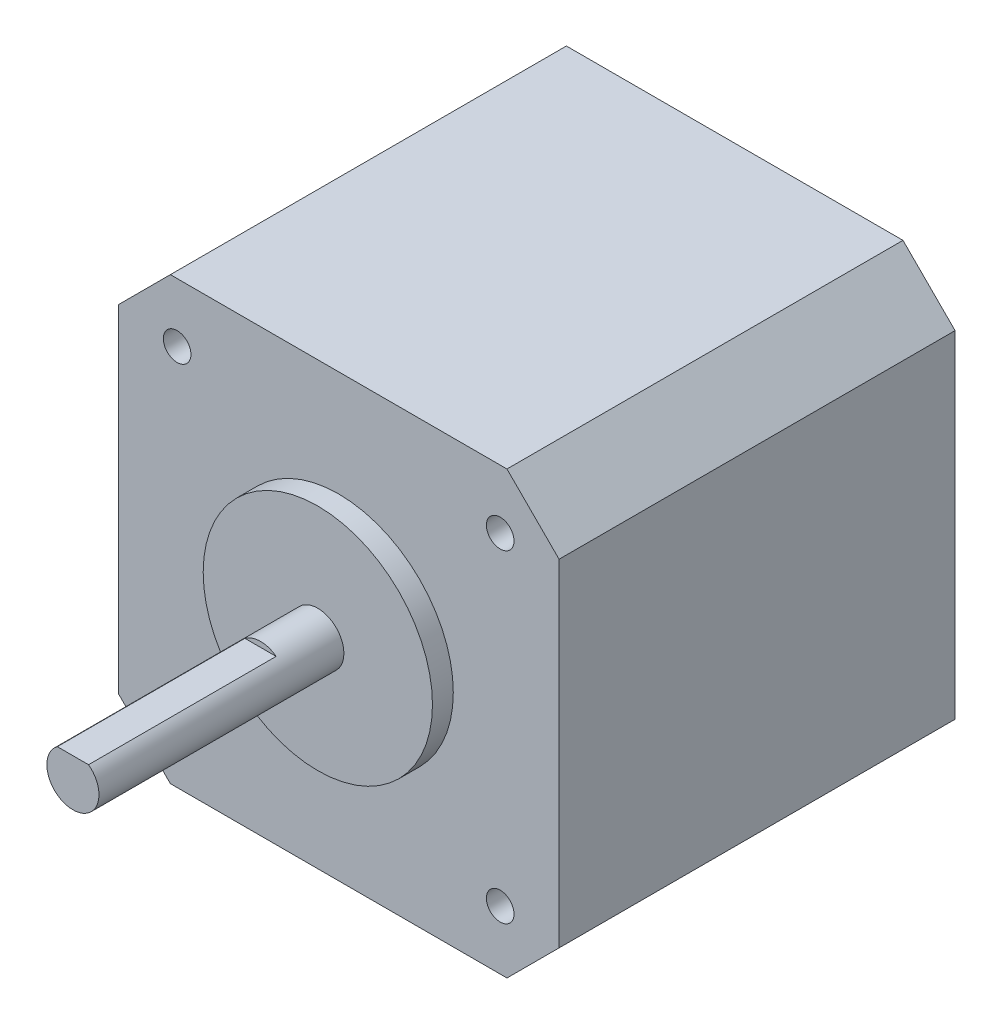
ISO-10303-21;
HEADER;
FILE_DESCRIPTION(('STEP AP214'),'2;1');
FILE_NAME('part.step','',(''),(''),'','','');
FILE_SCHEMA(('AUTOMOTIVE_DESIGN { 1 0 10303 214 1 1 1 1 }'));
ENDSEC;
DATA;
#1=APPLICATION_CONTEXT('core data for automotive mechanical design processes');
#2=APPLICATION_PROTOCOL_DEFINITION('international standard','automotive_design',2000,#1);
#3=PRODUCT_CONTEXT('',#1,'mechanical');
#4=PRODUCT('Part','Part','',(#3));
#5=PRODUCT_RELATED_PRODUCT_CATEGORY('part','',(#4));
#6=PRODUCT_DEFINITION_FORMATION('','',#4);
#7=PRODUCT_DEFINITION_CONTEXT('part definition',#1,'design');
#8=PRODUCT_DEFINITION('design','',#6,#7);
#9=PRODUCT_DEFINITION_SHAPE('','',#8);
#10=(LENGTH_UNIT() NAMED_UNIT(*) SI_UNIT(.MILLI.,.METRE.));
#11=(NAMED_UNIT(*) PLANE_ANGLE_UNIT() SI_UNIT($,.RADIAN.));
#12=(NAMED_UNIT(*) SI_UNIT($,.STERADIAN.) SOLID_ANGLE_UNIT());
#13=UNCERTAINTY_MEASURE_WITH_UNIT(LENGTH_MEASURE(1.E-05),#10,'distance_accuracy_value','');
#14=(GEOMETRIC_REPRESENTATION_CONTEXT(3) GLOBAL_UNCERTAINTY_ASSIGNED_CONTEXT((#13)) GLOBAL_UNIT_ASSIGNED_CONTEXT((#10,
#11,#12)) REPRESENTATION_CONTEXT('',''));
#15=CARTESIAN_POINT('',(0.,0.,0.));
#16=DIRECTION('',(0.,0.,1.));
#17=DIRECTION('',(1.,0.,0.));
#18=AXIS2_PLACEMENT_3D('',#15,#16,#17);
#19=CARTESIAN_POINT('',(-21.15,-16.15,-38.));
#20=DIRECTION('',(-1.,0.,0.));
#21=DIRECTION('',(0.,0.,1.));
#22=AXIS2_PLACEMENT_3D('',#19,#20,#21);
#23=PLANE('',#22);
#24=DIRECTION('',(0.,-1.,0.));
#25=VECTOR('',#24,1.);
#26=CARTESIAN_POINT('',(-21.15,-16.15,0.));
#27=LINE('',#26,#25);
#28=CARTESIAN_POINT('',(-21.1500000000002,16.15,0.));
#29=VERTEX_POINT('',#28);
#30=CARTESIAN_POINT('',(-21.15,-16.15,0.));
#31=VERTEX_POINT('',#30);
#32=EDGE_CURVE('E152',#29,#31,#27,.T.);
#33=ORIENTED_EDGE('',*,*,#32,.F.);
#34=DIRECTION('',(0.,0.,1.));
#35=VECTOR('',#34,1.);
#36=CARTESIAN_POINT('',(-21.15,16.15,-38.));
#37=LINE('',#36,#35);
#38=CARTESIAN_POINT('',(-21.15,16.15,-38.));
#39=VERTEX_POINT('',#38);
#40=EDGE_CURVE('E64',#39,#29,#37,.T.);
#41=ORIENTED_EDGE('',*,*,#40,.F.);
#42=DIRECTION('',(0.,-1.,0.));
#43=VECTOR('',#42,1.);
#44=CARTESIAN_POINT('',(-21.15,-16.15,-38.));
#45=LINE('',#44,#43);
#46=CARTESIAN_POINT('',(-21.15,-16.15,-38.));
#47=VERTEX_POINT('',#46);
#48=EDGE_CURVE('E174',#39,#47,#45,.T.);
#49=ORIENTED_EDGE('',*,*,#48,.T.);
#50=DIRECTION('',(0.,0.,1.));
#51=VECTOR('',#50,1.);
#52=CARTESIAN_POINT('',(-21.15,-16.15,-38.));
#53=LINE('',#52,#51);
#54=EDGE_CURVE('E103',#47,#31,#53,.T.);
#55=ORIENTED_EDGE('',*,*,#54,.T.);
#56=EDGE_LOOP('',(#33,#41,#49,#55));
#57=FACE_BOUND('',#56,.T.);
#58=ADVANCED_FACE('F40',(#57),#23,.T.);
#59=CARTESIAN_POINT('',(-21.15,16.15,-38.));
#60=DIRECTION('',(-0.707106781186548,0.707106781186548,0.));
#61=DIRECTION('',(-0.707106781186548,-0.707106781186548,0.));
#62=AXIS2_PLACEMENT_3D('',#59,#60,#61);
#63=PLANE('',#62);
#64=DIRECTION('',(-0.707106781186548,-0.707106781186548,0.));
#65=VECTOR('',#64,1.);
#66=CARTESIAN_POINT('',(-21.1500000000002,16.15,0.));
#67=LINE('',#66,#65);
#68=CARTESIAN_POINT('',(-16.1500000000002,21.15,0.));
#69=VERTEX_POINT('',#68);
#70=EDGE_CURVE('E171',#69,#29,#67,.T.);
#71=ORIENTED_EDGE('',*,*,#70,.F.);
#72=DIRECTION('',(0.,0.,1.));
#73=VECTOR('',#72,1.);
#74=CARTESIAN_POINT('',(-16.15,21.15,-38.));
#75=LINE('',#74,#73);
#76=CARTESIAN_POINT('',(-16.15,21.15,-38.));
#77=VERTEX_POINT('',#76);
#78=EDGE_CURVE('E133',#77,#69,#75,.T.);
#79=ORIENTED_EDGE('',*,*,#78,.F.);
#80=DIRECTION('',(-0.707106781186548,-0.707106781186548,0.));
#81=VECTOR('',#80,1.);
#82=CARTESIAN_POINT('',(-21.15,16.15,-38.));
#83=LINE('',#82,#81);
#84=EDGE_CURVE('E142',#77,#39,#83,.T.);
#85=ORIENTED_EDGE('',*,*,#84,.T.);
#86=ORIENTED_EDGE('',*,*,#40,.T.);
#87=EDGE_LOOP('',(#71,#79,#85,#86));
#88=FACE_BOUND('',#87,.T.);
#89=ADVANCED_FACE('F187',(#88),#63,.T.);
#90=CARTESIAN_POINT('',(-16.15,21.15,-38.));
#91=DIRECTION('',(0.,1.,0.));
#92=DIRECTION('',(0.,0.,1.));
#93=AXIS2_PLACEMENT_3D('',#90,#91,#92);
#94=PLANE('',#93);
#95=DIRECTION('',(-1.,0.,0.));
#96=VECTOR('',#95,1.);
#97=CARTESIAN_POINT('',(-16.1500000000002,21.15,0.));
#98=LINE('',#97,#96);
#99=CARTESIAN_POINT('',(16.1499999999998,21.15,0.));
#100=VERTEX_POINT('',#99);
#101=EDGE_CURVE('E128',#100,#69,#98,.T.);
#102=ORIENTED_EDGE('',*,*,#101,.F.);
#103=DIRECTION('',(0.,0.,1.));
#104=VECTOR('',#103,1.);
#105=CARTESIAN_POINT('',(16.1500000000001,21.15,-38.));
#106=LINE('',#105,#104);
#107=CARTESIAN_POINT('',(16.1500000000001,21.15,-38.));
#108=VERTEX_POINT('',#107);
#109=EDGE_CURVE('E122',#108,#100,#106,.T.);
#110=ORIENTED_EDGE('',*,*,#109,.F.);
#111=DIRECTION('',(-1.,0.,0.));
#112=VECTOR('',#111,1.);
#113=CARTESIAN_POINT('',(-16.15,21.15,-38.));
#114=LINE('',#113,#112);
#115=EDGE_CURVE('E125',#108,#77,#114,.T.);
#116=ORIENTED_EDGE('',*,*,#115,.T.);
#117=ORIENTED_EDGE('',*,*,#78,.T.);
#118=EDGE_LOOP('',(#102,#110,#116,#117));
#119=FACE_BOUND('',#118,.T.);
#120=ADVANCED_FACE('F124',(#119),#94,.T.);
#121=CARTESIAN_POINT('',(16.1500000000001,21.15,-38.));
#122=DIRECTION('',(0.707106781186548,0.707106781186548,0.));
#123=DIRECTION('',(-0.707106781186548,0.707106781186548,0.));
#124=AXIS2_PLACEMENT_3D('',#121,#122,#123);
#125=PLANE('',#124);
#126=DIRECTION('',(-0.707106781186548,0.707106781186548,0.));
#127=VECTOR('',#126,1.);
#128=CARTESIAN_POINT('',(16.1499999999998,21.15,0.));
#129=LINE('',#128,#127);
#130=CARTESIAN_POINT('',(21.1499999999998,16.15,0.));
#131=VERTEX_POINT('',#130);
#132=EDGE_CURVE('E168',#131,#100,#129,.T.);
#133=ORIENTED_EDGE('',*,*,#132,.F.);
#134=DIRECTION('',(0.,0.,1.));
#135=VECTOR('',#134,1.);
#136=CARTESIAN_POINT('',(21.1500000000001,16.15,-38.));
#137=LINE('',#136,#135);
#138=CARTESIAN_POINT('',(21.1500000000001,16.15,-38.));
#139=VERTEX_POINT('',#138);
#140=EDGE_CURVE('E134',#139,#131,#137,.T.);
#141=ORIENTED_EDGE('',*,*,#140,.F.);
#142=DIRECTION('',(-0.707106781186548,0.707106781186548,0.));
#143=VECTOR('',#142,1.);
#144=CARTESIAN_POINT('',(16.1500000000001,21.15,-38.));
#145=LINE('',#144,#143);
#146=EDGE_CURVE('E140',#139,#108,#145,.T.);
#147=ORIENTED_EDGE('',*,*,#146,.T.);
#148=ORIENTED_EDGE('',*,*,#109,.T.);
#149=EDGE_LOOP('',(#133,#141,#147,#148));
#150=FACE_BOUND('',#149,.T.);
#151=ADVANCED_FACE('F144',(#150),#125,.T.);
#152=CARTESIAN_POINT('',(21.1500000000001,-16.15,-38.));
#153=DIRECTION('',(1.,0.,0.));
#154=DIRECTION('',(0.,0.,-1.));
#155=AXIS2_PLACEMENT_3D('',#152,#153,#154);
#156=PLANE('',#155);
#157=DIRECTION('',(0.,1.,0.));
#158=VECTOR('',#157,1.);
#159=CARTESIAN_POINT('',(21.15,-16.15,0.));
#160=LINE('',#159,#158);
#161=CARTESIAN_POINT('',(21.15,-16.15,0.));
#162=VERTEX_POINT('',#161);
#163=EDGE_CURVE('E165',#162,#131,#160,.T.);
#164=ORIENTED_EDGE('',*,*,#163,.F.);
#165=DIRECTION('',(0.,0.,1.));
#166=VECTOR('',#165,1.);
#167=CARTESIAN_POINT('',(21.1500000000001,-16.15,-38.));
#168=LINE('',#167,#166);
#169=CARTESIAN_POINT('',(21.1500000000001,-16.15,-38.));
#170=VERTEX_POINT('',#169);
#171=EDGE_CURVE('E178',#170,#162,#168,.T.);
#172=ORIENTED_EDGE('',*,*,#171,.F.);
#173=DIRECTION('',(0.,1.,0.));
#174=VECTOR('',#173,1.);
#175=CARTESIAN_POINT('',(21.1500000000001,-16.15,-38.));
#176=LINE('',#175,#174);
#177=EDGE_CURVE('E145',#170,#139,#176,.T.);
#178=ORIENTED_EDGE('',*,*,#177,.T.);
#179=ORIENTED_EDGE('',*,*,#140,.T.);
#180=EDGE_LOOP('',(#164,#172,#178,#179));
#181=FACE_BOUND('',#180,.T.);
#182=ADVANCED_FACE('F200',(#181),#156,.T.);
#183=CARTESIAN_POINT('',(16.1500000000001,-21.15,-38.));
#184=DIRECTION('',(0.707106781186548,-0.707106781186548,0.));
#185=DIRECTION('',(0.707106781186548,0.707106781186548,0.));
#186=AXIS2_PLACEMENT_3D('',#183,#184,#185);
#187=PLANE('',#186);
#188=DIRECTION('',(0.707106781186548,0.707106781186548,0.));
#189=VECTOR('',#188,1.);
#190=CARTESIAN_POINT('',(16.15,-21.15,0.));
#191=LINE('',#190,#189);
#192=CARTESIAN_POINT('',(16.15,-21.15,0.));
#193=VERTEX_POINT('',#192);
#194=EDGE_CURVE('E162',#193,#162,#191,.T.);
#195=ORIENTED_EDGE('',*,*,#194,.F.);
#196=DIRECTION('',(0.,0.,1.));
#197=VECTOR('',#196,1.);
#198=CARTESIAN_POINT('',(16.1500000000001,-21.15,-38.));
#199=LINE('',#198,#197);
#200=CARTESIAN_POINT('',(16.1500000000001,-21.15,-38.));
#201=VERTEX_POINT('',#200);
#202=EDGE_CURVE('E180',#201,#193,#199,.T.);
#203=ORIENTED_EDGE('',*,*,#202,.F.);
#204=DIRECTION('',(0.707106781186548,0.707106781186548,0.));
#205=VECTOR('',#204,1.);
#206=CARTESIAN_POINT('',(16.1500000000001,-21.15,-38.));
#207=LINE('',#206,#205);
#208=EDGE_CURVE('E147',#201,#170,#207,.T.);
#209=ORIENTED_EDGE('',*,*,#208,.T.);
#210=ORIENTED_EDGE('',*,*,#171,.T.);
#211=EDGE_LOOP('',(#195,#203,#209,#210));
#212=FACE_BOUND('',#211,.T.);
#213=ADVANCED_FACE('F203',(#212),#187,.T.);
#214=CARTESIAN_POINT('',(-16.15,-21.15,-38.));
#215=DIRECTION('',(0.,-1.,0.));
#216=DIRECTION('',(0.,0.,-1.));
#217=AXIS2_PLACEMENT_3D('',#214,#215,#216);
#218=PLANE('',#217);
#219=DIRECTION('',(1.,0.,0.));
#220=VECTOR('',#219,1.);
#221=CARTESIAN_POINT('',(-16.15,-21.15,0.));
#222=LINE('',#221,#220);
#223=CARTESIAN_POINT('',(-16.15,-21.15,0.));
#224=VERTEX_POINT('',#223);
#225=EDGE_CURVE('E159',#224,#193,#222,.T.);
#226=ORIENTED_EDGE('',*,*,#225,.F.);
#227=DIRECTION('',(0.,0.,1.));
#228=VECTOR('',#227,1.);
#229=CARTESIAN_POINT('',(-16.15,-21.15,-38.));
#230=LINE('',#229,#228);
#231=CARTESIAN_POINT('',(-16.15,-21.15,-38.));
#232=VERTEX_POINT('',#231);
#233=EDGE_CURVE('E182',#232,#224,#230,.T.);
#234=ORIENTED_EDGE('',*,*,#233,.F.);
#235=DIRECTION('',(1.,0.,0.));
#236=VECTOR('',#235,1.);
#237=CARTESIAN_POINT('',(-16.15,-21.15,-38.));
#238=LINE('',#237,#236);
#239=EDGE_CURVE('E329',#232,#201,#238,.T.);
#240=ORIENTED_EDGE('',*,*,#239,.T.);
#241=ORIENTED_EDGE('',*,*,#202,.T.);
#242=EDGE_LOOP('',(#226,#234,#240,#241));
#243=FACE_BOUND('',#242,.T.);
#244=ADVANCED_FACE('F207',(#243),#218,.T.);
#245=CARTESIAN_POINT('',(-21.15,-16.15,-38.));
#246=DIRECTION('',(-0.707106781186548,-0.707106781186548,0.));
#247=DIRECTION('',(0.707106781186548,-0.707106781186548,0.));
#248=AXIS2_PLACEMENT_3D('',#245,#246,#247);
#249=PLANE('',#248);
#250=DIRECTION('',(0.707106781186548,-0.707106781186548,0.));
#251=VECTOR('',#250,1.);
#252=CARTESIAN_POINT('',(-21.15,-16.15,0.));
#253=LINE('',#252,#251);
#254=EDGE_CURVE('E155',#31,#224,#253,.T.);
#255=ORIENTED_EDGE('',*,*,#254,.F.);
#256=ORIENTED_EDGE('',*,*,#54,.F.);
#257=DIRECTION('',(0.707106781186548,-0.707106781186548,0.));
#258=VECTOR('',#257,1.);
#259=CARTESIAN_POINT('',(-21.15,-16.15,-38.));
#260=LINE('',#259,#258);
#261=EDGE_CURVE('E327',#47,#232,#260,.T.);
#262=ORIENTED_EDGE('',*,*,#261,.T.);
#263=ORIENTED_EDGE('',*,*,#233,.T.);
#264=EDGE_LOOP('',(#255,#256,#262,#263));
#265=FACE_BOUND('',#264,.T.);
#266=ADVANCED_FACE('F183',(#265),#249,.T.);
#267=CARTESIAN_POINT('',(0.,0.,-38.));
#268=DIRECTION('',(0.,0.,-1.));
#269=DIRECTION('',(-1.,0.,0.));
#270=AXIS2_PLACEMENT_3D('',#267,#268,#269);
#271=PLANE('',#270);
#272=ORIENTED_EDGE('',*,*,#48,.F.);
#273=ORIENTED_EDGE('',*,*,#84,.F.);
#274=ORIENTED_EDGE('',*,*,#115,.F.);
#275=ORIENTED_EDGE('',*,*,#146,.F.);
#276=ORIENTED_EDGE('',*,*,#177,.F.);
#277=ORIENTED_EDGE('',*,*,#208,.F.);
#278=ORIENTED_EDGE('',*,*,#239,.F.);
#279=ORIENTED_EDGE('',*,*,#261,.F.);
#280=EDGE_LOOP('',(#272,#273,#274,#275,#276,#277,#278,#279));
#281=FACE_BOUND('',#280,.T.);
#282=ADVANCED_FACE('F138',(#281),#271,.T.);
#283=CARTESIAN_POINT('',(0.,0.,0.));
#284=DIRECTION('',(0.,0.,-1.));
#285=DIRECTION('',(-1.,0.,0.));
#286=AXIS2_PLACEMENT_3D('',#283,#284,#285);
#287=PLANE('',#286);
#288=CARTESIAN_POINT('',(0.,0.,0.));
#289=DIRECTION('',(0.,0.,-1.));
#290=DIRECTION('',(-1.,0.,0.));
#291=AXIS2_PLACEMENT_3D('',#288,#289,#290);
#292=CIRCLE('',#291,11.);
#293=CARTESIAN_POINT('',(-11.,0.,0.));
#294=VERTEX_POINT('',#293);
#295=EDGE_CURVE('E43',#294,#294,#292,.F.);
#296=ORIENTED_EDGE('',*,*,#295,.F.);
#297=EDGE_LOOP('',(#296));
#298=FACE_BOUND('',#297,.T.);
#299=CARTESIAN_POINT('',(-15.5,15.5,0.));
#300=DIRECTION('',(0.,0.,1.));
#301=DIRECTION('',(1.,0.,0.));
#302=AXIS2_PLACEMENT_3D('',#299,#300,#301);
#303=CIRCLE('',#302,1.325);
#304=CARTESIAN_POINT('',(-14.175,15.5,0.));
#305=VERTEX_POINT('',#304);
#306=EDGE_CURVE('E303',#305,#305,#303,.T.);
#307=ORIENTED_EDGE('',*,*,#306,.F.);
#308=EDGE_LOOP('',(#307));
#309=FACE_BOUND('',#308,.T.);
#310=CARTESIAN_POINT('',(15.5,15.5,0.));
#311=DIRECTION('',(0.,0.,1.));
#312=DIRECTION('',(1.,0.,0.));
#313=AXIS2_PLACEMENT_3D('',#310,#311,#312);
#314=CIRCLE('',#313,1.325);
#315=CARTESIAN_POINT('',(16.825,15.5,0.));
#316=VERTEX_POINT('',#315);
#317=EDGE_CURVE('E309',#316,#316,#314,.T.);
#318=ORIENTED_EDGE('',*,*,#317,.F.);
#319=EDGE_LOOP('',(#318));
#320=FACE_BOUND('',#319,.T.);
#321=CARTESIAN_POINT('',(15.5,-15.5,0.));
#322=DIRECTION('',(0.,0.,1.));
#323=DIRECTION('',(1.,0.,0.));
#324=AXIS2_PLACEMENT_3D('',#321,#322,#323);
#325=CIRCLE('',#324,1.325);
#326=CARTESIAN_POINT('',(16.825,-15.5,0.));
#327=VERTEX_POINT('',#326);
#328=EDGE_CURVE('E315',#327,#327,#325,.T.);
#329=ORIENTED_EDGE('',*,*,#328,.F.);
#330=EDGE_LOOP('',(#329));
#331=FACE_BOUND('',#330,.T.);
#332=CARTESIAN_POINT('',(-15.5,-15.5,0.));
#333=DIRECTION('',(0.,0.,1.));
#334=DIRECTION('',(1.,0.,0.));
#335=AXIS2_PLACEMENT_3D('',#332,#333,#334);
#336=CIRCLE('',#335,1.325);
#337=CARTESIAN_POINT('',(-14.175,-15.5,0.));
#338=VERTEX_POINT('',#337);
#339=EDGE_CURVE('E321',#338,#338,#336,.T.);
#340=ORIENTED_EDGE('',*,*,#339,.F.);
#341=EDGE_LOOP('',(#340));
#342=FACE_BOUND('',#341,.T.);
#343=ORIENTED_EDGE('',*,*,#32,.T.);
#344=ORIENTED_EDGE('',*,*,#254,.T.);
#345=ORIENTED_EDGE('',*,*,#225,.T.);
#346=ORIENTED_EDGE('',*,*,#194,.T.);
#347=ORIENTED_EDGE('',*,*,#163,.T.);
#348=ORIENTED_EDGE('',*,*,#132,.T.);
#349=ORIENTED_EDGE('',*,*,#101,.T.);
#350=ORIENTED_EDGE('',*,*,#70,.T.);
#351=EDGE_LOOP('',(#343,#344,#345,#346,#347,#348,#349,#350));
#352=FACE_BOUND('',#351,.T.);
#353=ADVANCED_FACE('F186',(#298,#309,#320,#331,#342,#352),#287,.F.);
#354=CARTESIAN_POINT('',(-15.5,-15.5,-7.75));
#355=DIRECTION('',(0.,0.,1.));
#356=DIRECTION('',(1.,0.,0.));
#357=AXIS2_PLACEMENT_3D('',#354,#355,#356);
#358=CONICAL_SURFACE('',#357,1.325,1.02974425867665);
#359=CARTESIAN_POINT('',(-15.5,-15.5,-8.54614032021151));
#360=VERTEX_POINT('',#359);
#361=VERTEX_LOOP('',#360);
#362=FACE_BOUND('',#361,.T.);
#363=CARTESIAN_POINT('',(-15.5,-15.5,-7.75));
#364=DIRECTION('',(0.,0.,1.));
#365=DIRECTION('',(1.,0.,0.));
#366=AXIS2_PLACEMENT_3D('',#363,#364,#365);
#367=CIRCLE('',#366,1.325);
#368=CARTESIAN_POINT('',(-14.175,-15.5,-7.75));
#369=VERTEX_POINT('',#368);
#370=EDGE_CURVE('E156',#369,#369,#367,.T.);
#371=ORIENTED_EDGE('',*,*,#370,.T.);
#372=EDGE_LOOP('',(#371));
#373=FACE_BOUND('',#372,.T.);
#374=ADVANCED_FACE('F218',(#362,#373),#358,.F.);
#375=CARTESIAN_POINT('',(-15.5,-15.5,0.));
#376=DIRECTION('',(0.,0.,1.));
#377=DIRECTION('',(1.,0.,0.));
#378=AXIS2_PLACEMENT_3D('',#375,#376,#377);
#379=CYLINDRICAL_SURFACE('',#378,1.325);
#380=ORIENTED_EDGE('',*,*,#370,.F.);
#381=EDGE_LOOP('',(#380));
#382=FACE_BOUND('',#381,.T.);
#383=ORIENTED_EDGE('',*,*,#339,.T.);
#384=EDGE_LOOP('',(#383));
#385=FACE_BOUND('',#384,.T.);
#386=ADVANCED_FACE('F223',(#382,#385),#379,.F.);
#387=CARTESIAN_POINT('',(15.5,-15.5,-7.75));
#388=DIRECTION('',(0.,0.,1.));
#389=DIRECTION('',(1.,0.,0.));
#390=AXIS2_PLACEMENT_3D('',#387,#388,#389);
#391=CONICAL_SURFACE('',#390,1.325,1.02974425867665);
#392=CARTESIAN_POINT('',(15.5,-15.5,-8.54614032021151));
#393=VERTEX_POINT('',#392);
#394=VERTEX_LOOP('',#393);
#395=FACE_BOUND('',#394,.T.);
#396=CARTESIAN_POINT('',(15.5,-15.5,-7.75));
#397=DIRECTION('',(0.,0.,1.));
#398=DIRECTION('',(1.,0.,0.));
#399=AXIS2_PLACEMENT_3D('',#396,#397,#398);
#400=CIRCLE('',#399,1.325);
#401=CARTESIAN_POINT('',(16.825,-15.5,-7.75));
#402=VERTEX_POINT('',#401);
#403=EDGE_CURVE('E318',#402,#402,#400,.T.);
#404=ORIENTED_EDGE('',*,*,#403,.T.);
#405=EDGE_LOOP('',(#404));
#406=FACE_BOUND('',#405,.T.);
#407=ADVANCED_FACE('F227',(#395,#406),#391,.F.);
#408=CARTESIAN_POINT('',(15.5,-15.5,0.));
#409=DIRECTION('',(0.,0.,1.));
#410=DIRECTION('',(1.,0.,0.));
#411=AXIS2_PLACEMENT_3D('',#408,#409,#410);
#412=CYLINDRICAL_SURFACE('',#411,1.325);
#413=ORIENTED_EDGE('',*,*,#403,.F.);
#414=EDGE_LOOP('',(#413));
#415=FACE_BOUND('',#414,.T.);
#416=ORIENTED_EDGE('',*,*,#328,.T.);
#417=EDGE_LOOP('',(#416));
#418=FACE_BOUND('',#417,.T.);
#419=ADVANCED_FACE('F231',(#415,#418),#412,.F.);
#420=CARTESIAN_POINT('',(15.5,15.5,-7.75));
#421=DIRECTION('',(0.,0.,1.));
#422=DIRECTION('',(1.,0.,0.));
#423=AXIS2_PLACEMENT_3D('',#420,#421,#422);
#424=CONICAL_SURFACE('',#423,1.325,1.02974425867665);
#425=CARTESIAN_POINT('',(15.5,15.5,-8.54614032021151));
#426=VERTEX_POINT('',#425);
#427=VERTEX_LOOP('',#426);
#428=FACE_BOUND('',#427,.T.);
#429=CARTESIAN_POINT('',(15.5,15.5,-7.75));
#430=DIRECTION('',(0.,0.,1.));
#431=DIRECTION('',(1.,0.,0.));
#432=AXIS2_PLACEMENT_3D('',#429,#430,#431);
#433=CIRCLE('',#432,1.325);
#434=CARTESIAN_POINT('',(16.825,15.5,-7.75));
#435=VERTEX_POINT('',#434);
#436=EDGE_CURVE('E312',#435,#435,#433,.T.);
#437=ORIENTED_EDGE('',*,*,#436,.T.);
#438=EDGE_LOOP('',(#437));
#439=FACE_BOUND('',#438,.T.);
#440=ADVANCED_FACE('F235',(#428,#439),#424,.F.);
#441=CARTESIAN_POINT('',(15.5,15.5,0.));
#442=DIRECTION('',(0.,0.,1.));
#443=DIRECTION('',(1.,0.,0.));
#444=AXIS2_PLACEMENT_3D('',#441,#442,#443);
#445=CYLINDRICAL_SURFACE('',#444,1.325);
#446=ORIENTED_EDGE('',*,*,#436,.F.);
#447=EDGE_LOOP('',(#446));
#448=FACE_BOUND('',#447,.T.);
#449=ORIENTED_EDGE('',*,*,#317,.T.);
#450=EDGE_LOOP('',(#449));
#451=FACE_BOUND('',#450,.T.);
#452=ADVANCED_FACE('F239',(#448,#451),#445,.F.);
#453=CARTESIAN_POINT('',(-15.5,15.5,-7.75));
#454=DIRECTION('',(0.,0.,1.));
#455=DIRECTION('',(1.,0.,0.));
#456=AXIS2_PLACEMENT_3D('',#453,#454,#455);
#457=CONICAL_SURFACE('',#456,1.325,1.02974425867665);
#458=CARTESIAN_POINT('',(-15.5,15.5,-8.54614032021152));
#459=VERTEX_POINT('',#458);
#460=VERTEX_LOOP('',#459);
#461=FACE_BOUND('',#460,.T.);
#462=CARTESIAN_POINT('',(-15.5,15.5,-7.75));
#463=DIRECTION('',(0.,0.,1.));
#464=DIRECTION('',(1.,0.,0.));
#465=AXIS2_PLACEMENT_3D('',#462,#463,#464);
#466=CIRCLE('',#465,1.325);
#467=CARTESIAN_POINT('',(-14.175,15.5,-7.75));
#468=VERTEX_POINT('',#467);
#469=EDGE_CURVE('E306',#468,#468,#466,.T.);
#470=ORIENTED_EDGE('',*,*,#469,.T.);
#471=EDGE_LOOP('',(#470));
#472=FACE_BOUND('',#471,.T.);
#473=ADVANCED_FACE('F243',(#461,#472),#457,.F.);
#474=CARTESIAN_POINT('',(-15.5,15.5,0.));
#475=DIRECTION('',(0.,0.,1.));
#476=DIRECTION('',(1.,0.,0.));
#477=AXIS2_PLACEMENT_3D('',#474,#475,#476);
#478=CYLINDRICAL_SURFACE('',#477,1.325);
#479=ORIENTED_EDGE('',*,*,#469,.F.);
#480=EDGE_LOOP('',(#479));
#481=FACE_BOUND('',#480,.T.);
#482=ORIENTED_EDGE('',*,*,#306,.T.);
#483=EDGE_LOOP('',(#482));
#484=FACE_BOUND('',#483,.T.);
#485=ADVANCED_FACE('F247',(#481,#484),#478,.F.);
#486=CARTESIAN_POINT('',(0.,0.,2.));
#487=DIRECTION('',(0.,0.,-1.));
#488=DIRECTION('',(-1.,0.,0.));
#489=AXIS2_PLACEMENT_3D('',#486,#487,#488);
#490=CYLINDRICAL_SURFACE('',#489,11.);
#491=CARTESIAN_POINT('',(0.,0.,2.));
#492=DIRECTION('',(0.,0.,1.));
#493=DIRECTION('',(1.,0.,0.));
#494=AXIS2_PLACEMENT_3D('',#491,#492,#493);
#495=CIRCLE('',#494,11.);
#496=CARTESIAN_POINT('',(11.,0.,2.));
#497=VERTEX_POINT('',#496);
#498=EDGE_CURVE('E299',#497,#497,#495,.T.);
#499=ORIENTED_EDGE('',*,*,#498,.F.);
#500=EDGE_LOOP('',(#499));
#501=FACE_BOUND('',#500,.T.);
#502=ORIENTED_EDGE('',*,*,#295,.T.);
#503=EDGE_LOOP('',(#502));
#504=FACE_BOUND('',#503,.T.);
#505=ADVANCED_FACE('F251',(#501,#504),#490,.T.);
#506=CARTESIAN_POINT('',(0.,0.,2.));
#507=DIRECTION('',(0.,0.,1.));
#508=DIRECTION('',(1.,0.,0.));
#509=AXIS2_PLACEMENT_3D('',#506,#507,#508);
#510=PLANE('',#509);
#511=CARTESIAN_POINT('',(0.,0.,2.));
#512=DIRECTION('',(0.,0.,1.));
#513=DIRECTION('',(1.,0.,0.));
#514=AXIS2_PLACEMENT_3D('',#511,#512,#513);
#515=CIRCLE('',#514,2.5);
#516=CARTESIAN_POINT('',(2.5,0.,2.));
#517=VERTEX_POINT('',#516);
#518=EDGE_CURVE('E11',#517,#517,#515,.T.);
#519=ORIENTED_EDGE('',*,*,#518,.F.);
#520=EDGE_LOOP('',(#519));
#521=FACE_BOUND('',#520,.T.);
#522=ORIENTED_EDGE('',*,*,#498,.T.);
#523=EDGE_LOOP('',(#522));
#524=FACE_BOUND('',#523,.T.);
#525=ADVANCED_FACE('F255',(#521,#524),#510,.T.);
#526=CARTESIAN_POINT('',(0.,0.,25.5));
#527=DIRECTION('',(0.,0.,-1.));
#528=DIRECTION('',(-1.,0.,0.));
#529=AXIS2_PLACEMENT_3D('',#526,#527,#528);
#530=CYLINDRICAL_SURFACE('',#529,2.5);
#531=CARTESIAN_POINT('',(0.,0.,25.5));
#532=DIRECTION('',(0.,0.,1.));
#533=DIRECTION('',(1.,0.,0.));
#534=AXIS2_PLACEMENT_3D('',#531,#532,#533);
#535=CIRCLE('',#534,2.5);
#536=CARTESIAN_POINT('',(-1.5,2.,25.5));
#537=VERTEX_POINT('',#536);
#538=CARTESIAN_POINT('',(1.5,2.,25.5));
#539=VERTEX_POINT('',#538);
#540=EDGE_CURVE('E294',#537,#539,#535,.T.);
#541=ORIENTED_EDGE('',*,*,#540,.F.);
#542=DIRECTION('',(0.,0.,1.));
#543=VECTOR('',#542,1.);
#544=CARTESIAN_POINT('',(-1.5,2.,7.5));
#545=LINE('',#544,#543);
#546=CARTESIAN_POINT('',(-1.5,2.,7.5));
#547=VERTEX_POINT('',#546);
#548=EDGE_CURVE('E55',#547,#537,#545,.T.);
#549=ORIENTED_EDGE('',*,*,#548,.F.);
#550=CARTESIAN_POINT('',(0.,0.,7.5));
#551=DIRECTION('',(0.,0.,1.));
#552=DIRECTION('',(-1.,0.,0.));
#553=AXIS2_PLACEMENT_3D('',#550,#551,#552);
#554=CIRCLE('',#553,2.5);
#555=CARTESIAN_POINT('',(1.5,2.,7.49999999999999));
#556=VERTEX_POINT('',#555);
#557=EDGE_CURVE('E280',#556,#547,#554,.T.);
#558=ORIENTED_EDGE('',*,*,#557,.F.);
#559=DIRECTION('',(0.,0.,1.));
#560=VECTOR('',#559,1.);
#561=CARTESIAN_POINT('',(1.5,2.,7.49999999999999));
#562=LINE('',#561,#560);
#563=EDGE_CURVE('E289',#556,#539,#562,.T.);
#564=ORIENTED_EDGE('',*,*,#563,.T.);
#565=EDGE_LOOP('',(#541,#549,#558,#564));
#566=FACE_BOUND('',#565,.T.);
#567=ORIENTED_EDGE('',*,*,#518,.T.);
#568=EDGE_LOOP('',(#567));
#569=FACE_BOUND('',#568,.T.);
#570=ADVANCED_FACE('F259',(#566,#569),#530,.T.);
#571=CARTESIAN_POINT('',(0.,0.,25.5));
#572=DIRECTION('',(0.,0.,1.));
#573=DIRECTION('',(1.,0.,0.));
#574=AXIS2_PLACEMENT_3D('',#571,#572,#573);
#575=PLANE('',#574);
#576=DIRECTION('',(1.,0.,0.));
#577=VECTOR('',#576,1.);
#578=CARTESIAN_POINT('',(-1.5,2.,25.5));
#579=LINE('',#578,#577);
#580=EDGE_CURVE('E286',#537,#539,#579,.T.);
#581=ORIENTED_EDGE('',*,*,#580,.F.);
#582=ORIENTED_EDGE('',*,*,#540,.T.);
#583=EDGE_LOOP('',(#581,#582));
#584=FACE_BOUND('',#583,.T.);
#585=ADVANCED_FACE('F263',(#584),#575,.T.);
#586=CARTESIAN_POINT('',(-1.5,2.,7.5));
#587=DIRECTION('',(0.,-1.,0.));
#588=DIRECTION('',(0.,0.,-1.));
#589=AXIS2_PLACEMENT_3D('',#586,#587,#588);
#590=PLANE('',#589);
#591=ORIENTED_EDGE('',*,*,#580,.T.);
#592=ORIENTED_EDGE('',*,*,#563,.F.);
#593=DIRECTION('',(1.,0.,0.));
#594=VECTOR('',#593,1.);
#595=CARTESIAN_POINT('',(-1.5,2.,7.5));
#596=LINE('',#595,#594);
#597=EDGE_CURVE('E282',#547,#556,#596,.T.);
#598=ORIENTED_EDGE('',*,*,#597,.F.);
#599=ORIENTED_EDGE('',*,*,#548,.T.);
#600=EDGE_LOOP('',(#591,#592,#598,#599));
#601=FACE_BOUND('',#600,.T.);
#602=ADVANCED_FACE('F267',(#601),#590,.F.);
#603=CARTESIAN_POINT('',(0.,0.,7.5));
#604=DIRECTION('',(0.,0.,-1.));
#605=DIRECTION('',(-1.,0.,0.));
#606=AXIS2_PLACEMENT_3D('',#603,#604,#605);
#607=PLANE('',#606);
#608=ORIENTED_EDGE('',*,*,#557,.T.);
#609=ORIENTED_EDGE('',*,*,#597,.T.);
#610=EDGE_LOOP('',(#608,#609));
#611=FACE_BOUND('',#610,.T.);
#612=ADVANCED_FACE('F271',(#611),#607,.F.);
#613=CLOSED_SHELL('',(#58,#89,#120,#151,#182,#213,#244,#266,#282,#353,#374,#386,#407,#419,#440,
#452,#473,#485,#505,#525,#570,#585,#602,#612));
#614=MANIFOLD_SOLID_BREP('B2',#613);
#615=ADVANCED_BREP_SHAPE_REPRESENTATION('',(#18,#614),#14);
#616=SHAPE_DEFINITION_REPRESENTATION(#9,#615);
ENDSEC;
END-ISO-10303-21;
